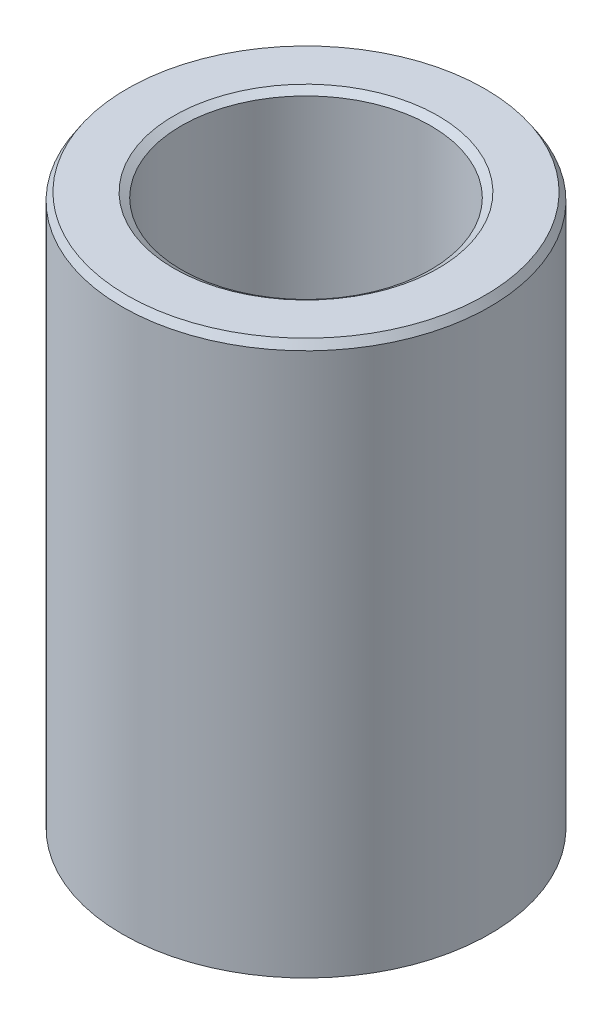
ISO-10303-21;
HEADER;
FILE_DESCRIPTION(('STEP AP214'),'2;1');
FILE_NAME('part.step','',(''),(''),'','','');
FILE_SCHEMA(('AUTOMOTIVE_DESIGN { 1 0 10303 214 1 1 1 1 }'));
ENDSEC;
DATA;
#1=APPLICATION_CONTEXT('core data for automotive mechanical design processes');
#2=APPLICATION_PROTOCOL_DEFINITION('international standard','automotive_design',2000,#1);
#3=PRODUCT_CONTEXT('',#1,'mechanical');
#4=PRODUCT('Part','Part','',(#3));
#5=PRODUCT_RELATED_PRODUCT_CATEGORY('part','',(#4));
#6=PRODUCT_DEFINITION_FORMATION('','',#4);
#7=PRODUCT_DEFINITION_CONTEXT('part definition',#1,'design');
#8=PRODUCT_DEFINITION('design','',#6,#7);
#9=PRODUCT_DEFINITION_SHAPE('','',#8);
#10=(LENGTH_UNIT() NAMED_UNIT(*) SI_UNIT(.MILLI.,.METRE.));
#11=(NAMED_UNIT(*) PLANE_ANGLE_UNIT() SI_UNIT($,.RADIAN.));
#12=(NAMED_UNIT(*) SI_UNIT($,.STERADIAN.) SOLID_ANGLE_UNIT());
#13=UNCERTAINTY_MEASURE_WITH_UNIT(LENGTH_MEASURE(1.E-05),#10,'distance_accuracy_value','');
#14=(GEOMETRIC_REPRESENTATION_CONTEXT(3) GLOBAL_UNCERTAINTY_ASSIGNED_CONTEXT((#13)) GLOBAL_UNIT_ASSIGNED_CONTEXT((#10,
#11,#12)) REPRESENTATION_CONTEXT('',''));
#15=CARTESIAN_POINT('',(0.,0.,0.));
#16=DIRECTION('',(0.,0.,1.));
#17=DIRECTION('',(1.,0.,0.));
#18=AXIS2_PLACEMENT_3D('',#15,#16,#17);
#19=CARTESIAN_POINT('',(0.,30.2188998802696,0.));
#20=DIRECTION('',(0.,-1.,0.));
#21=DIRECTION('',(0.,0.,-1.));
#22=AXIS2_PLACEMENT_3D('',#19,#20,#21);
#23=CYLINDRICAL_SURFACE('',#22,10.);
#24=CARTESIAN_POINT('',(0.,0.264981801475061,0.));
#25=DIRECTION('',(0.,1.,0.));
#26=DIRECTION('',(0.,0.,1.));
#27=AXIS2_PLACEMENT_3D('',#24,#25,#26);
#28=CIRCLE('',#27,10.);
#29=CARTESIAN_POINT('',(0.,0.264981801475061,-10.));
#30=VERTEX_POINT('',#29);
#31=EDGE_CURVE('E10',#30,#30,#28,.T.);
#32=CARTESIAN_POINT('',(0.,29.8114514143489,0.));
#33=DIRECTION('',(0.,1.,0.));
#34=DIRECTION('',(0.,0.,1.));
#35=AXIS2_PLACEMENT_3D('',#32,#33,#34);
#36=CIRCLE('',#35,10.);
#37=CARTESIAN_POINT('',(0.,29.8114514143489,-10.));
#38=VERTEX_POINT('',#37);
#39=EDGE_CURVE('E50',#38,#38,#36,.F.);
#40=CARTESIAN_POINT('',(0.,0.264981801475061,-10.));
#41=CARTESIAN_POINT('',(0.,0.572757526609163,-10.));
#42=CARTESIAN_POINT('',(0.,0.880533251743264,-10.));
#43=CARTESIAN_POINT('',(0.,1.49608470201147,-10.));
#44=CARTESIAN_POINT('',(0.,1.80386042714557,-10.));
#45=CARTESIAN_POINT('',(0.,2.41941187741378,-10.));
#46=CARTESIAN_POINT('',(0.,2.72718760254788,-10.));
#47=CARTESIAN_POINT('',(0.,3.34273905281608,-10.));
#48=CARTESIAN_POINT('',(0.,3.65051477795019,-10.));
#49=CARTESIAN_POINT('',(0.,4.26606622821839,-10.));
#50=CARTESIAN_POINT('',(0.,4.57384195335249,-10.));
#51=CARTESIAN_POINT('',(0.,5.1893934036207,-10.));
#52=CARTESIAN_POINT('',(0.,5.4971691287548,-10.));
#53=CARTESIAN_POINT('',(0.,6.112720579023,-10.));
#54=CARTESIAN_POINT('',(0.,6.42049630415711,-10.));
#55=CARTESIAN_POINT('',(0.,7.03604775442531,-10.));
#56=CARTESIAN_POINT('',(0.,7.34382347955941,-10.));
#57=CARTESIAN_POINT('',(0.,7.95937492982762,-10.));
#58=CARTESIAN_POINT('',(0.,8.26715065496172,-10.));
#59=CARTESIAN_POINT('',(0.,8.88270210522992,-10.));
#60=CARTESIAN_POINT('',(0.,9.19047783036403,-10.));
#61=CARTESIAN_POINT('',(0.,9.80602928063223,-10.));
#62=CARTESIAN_POINT('',(0.,10.1138050057663,-10.));
#63=CARTESIAN_POINT('',(0.,10.7293564560345,-10.));
#64=CARTESIAN_POINT('',(0.,11.0371321811686,-10.));
#65=CARTESIAN_POINT('',(0.,11.6526836314368,-10.));
#66=CARTESIAN_POINT('',(0.,11.9604593565709,-10.));
#67=CARTESIAN_POINT('',(0.,12.5760108068392,-10.));
#68=CARTESIAN_POINT('',(0.,12.8837865319733,-10.));
#69=CARTESIAN_POINT('',(0.,13.4993379822415,-10.));
#70=CARTESIAN_POINT('',(0.,13.8071137073756,-10.));
#71=CARTESIAN_POINT('',(0.,14.4226651576438,-10.));
#72=CARTESIAN_POINT('',(0.,14.7304408827779,-10.));
#73=CARTESIAN_POINT('',(0.,15.3459923330461,-10.));
#74=CARTESIAN_POINT('',(0.,15.6537680581802,-10.));
#75=CARTESIAN_POINT('',(0.,16.2693195084484,-10.));
#76=CARTESIAN_POINT('',(0.,16.5770952335825,-10.));
#77=CARTESIAN_POINT('',(0.,17.1926466838507,-10.));
#78=CARTESIAN_POINT('',(0.,17.5004224089848,-10.));
#79=CARTESIAN_POINT('',(0.,18.115973859253,-10.));
#80=CARTESIAN_POINT('',(0.,18.4237495843871,-10.));
#81=CARTESIAN_POINT('',(0.,19.0393010346553,-10.));
#82=CARTESIAN_POINT('',(0.,19.3470767597894,-10.));
#83=CARTESIAN_POINT('',(0.,19.9626282100576,-10.));
#84=CARTESIAN_POINT('',(0.,20.2704039351917,-10.));
#85=CARTESIAN_POINT('',(0.,20.8859553854599,-10.));
#86=CARTESIAN_POINT('',(0.,21.193731110594,-10.));
#87=CARTESIAN_POINT('',(0.,21.8092825608622,-10.));
#88=CARTESIAN_POINT('',(0.,22.1170582859963,-10.));
#89=CARTESIAN_POINT('',(0.,22.7326097362645,-10.));
#90=CARTESIAN_POINT('',(0.,23.0403854613986,-10.));
#91=CARTESIAN_POINT('',(0.,23.6559369116668,-10.));
#92=CARTESIAN_POINT('',(0.,23.9637126368009,-10.));
#93=CARTESIAN_POINT('',(0.,24.5792640870691,-10.));
#94=CARTESIAN_POINT('',(0.,24.8870398122032,-10.));
#95=CARTESIAN_POINT('',(0.,25.5025912624714,-10.));
#96=CARTESIAN_POINT('',(0.,25.8103669876055,-10.));
#97=CARTESIAN_POINT('',(0.,26.4259184378737,-10.));
#98=CARTESIAN_POINT('',(0.,26.7336941630079,-10.));
#99=CARTESIAN_POINT('',(0.,27.3492456132761,-10.));
#100=CARTESIAN_POINT('',(0.,27.6570213384102,-10.));
#101=CARTESIAN_POINT('',(0.,28.2725727886784,-10.));
#102=CARTESIAN_POINT('',(0.,28.5803485138125,-10.));
#103=CARTESIAN_POINT('',(0.,29.1958999640807,-10.));
#104=CARTESIAN_POINT('',(0.,29.5036756892148,-10.));
#105=CARTESIAN_POINT('',(0.,29.8114514143489,-10.));
#106=B_SPLINE_CURVE_WITH_KNOTS('',3,(#40,#41,#42,#43,#44,#45,#46,#47,#48,#49,#50,#51,#52,#53,
#54,#55,#56,#57,#58,#59,#60,#61,#62,#63,#64,#65,#66,#67,#68,#69,#70,#71,#72,#73,#74,#75,#76,#77,
#78,#79,#80,#81,#82,#83,#84,#85,#86,#87,#88,#89,#90,#91,#92,#93,#94,#95,#96,#97,#98,#99,#100,
#101,#102,#103,#104,#105),.UNSPECIFIED.,.F.,.F.,(4,2,2,2,2,2,2,2,2,2,2,2,2,2,2,2,2,2,2,2,2,2,2,
2,2,2,2,2,2,2,2,2,4),(0.,0.923327175402305,1.84665435080461,2.76998152620692,3.69330870160923,
4.61663587701153,5.53996305241384,6.46329022781615,7.38661740321845,8.30994457862076,
9.23327175402307,10.1565989294254,11.0799261048277,12.00325328023,12.9265804556323,
13.8499076310346,14.7732348064369,15.6965619818392,16.6198891572415,17.5432163326438,
18.4665435080461,19.3898706834484,20.3131978588507,21.2365250342531,22.1598522096554,
23.0831793850577,24.00650656046,24.9298337358623,25.8531609112646,26.7764880866669,
27.6998152620692,28.6231424374715,29.5464696128738),.UNSPECIFIED.);
#107=EDGE_CURVE('BSEAM39',#30,#38,#106,.T.);
#108=ORIENTED_EDGE('',*,*,#31,.T.);
#109=ORIENTED_EDGE('',*,*,#39,.T.);
#110=ORIENTED_EDGE('',*,*,#107,.T.);
#111=ORIENTED_EDGE('',*,*,#107,.F.);
#112=EDGE_LOOP('',(#108,#110,#109,#111));
#113=FACE_BOUND('',#112,.T.);
#114=ADVANCED_FACE('F39',(#113),#23,.T.);
#115=CARTESIAN_POINT('',(0.,30.2188998802696,0.));
#116=DIRECTION('',(0.,1.,0.));
#117=DIRECTION('',(0.,0.,1.));
#118=AXIS2_PLACEMENT_3D('',#115,#116,#117);
#119=PLANE('',#118);
#120=CARTESIAN_POINT('',(0.,30.2188998802696,0.));
#121=DIRECTION('',(0.,1.,0.));
#122=DIRECTION('',(0.,0.,1.));
#123=AXIS2_PLACEMENT_3D('',#120,#121,#122);
#124=CIRCLE('',#123,7.1906507334478);
#125=CARTESIAN_POINT('',(0.,30.2188998802696,7.1906507334478));
#126=VERTEX_POINT('',#125);
#127=EDGE_CURVE('E58',#126,#126,#124,.F.);
#128=ORIENTED_EDGE('',*,*,#127,.T.);
#129=EDGE_LOOP('',(#128));
#130=FACE_BOUND('',#129,.T.);
#131=CARTESIAN_POINT('',(0.,30.2188998802696,0.));
#132=DIRECTION('',(0.,1.,0.));
#133=DIRECTION('',(0.,0.,1.));
#134=AXIS2_PLACEMENT_3D('',#131,#132,#133);
#135=CIRCLE('',#134,9.73501819852497);
#136=CARTESIAN_POINT('',(0.,30.2188998802696,9.73501819852497));
#137=VERTEX_POINT('',#136);
#138=EDGE_CURVE('E61',#137,#137,#135,.T.);
#139=ORIENTED_EDGE('',*,*,#138,.T.);
#140=EDGE_LOOP('',(#139));
#141=FACE_BOUND('',#140,.T.);
#142=ADVANCED_FACE('F88',(#130,#141),#119,.T.);
#143=CARTESIAN_POINT('',(0.,0.,0.));
#144=DIRECTION('',(0.,1.,0.));
#145=DIRECTION('',(0.,0.,1.));
#146=AXIS2_PLACEMENT_3D('',#143,#144,#145);
#147=PLANE('',#146);
#148=CARTESIAN_POINT('',(0.,0.,0.));
#149=DIRECTION('',(0.,1.,0.));
#150=DIRECTION('',(0.,0.,1.));
#151=AXIS2_PLACEMENT_3D('',#148,#149,#150);
#152=CIRCLE('',#151,7.04818406900203);
#153=CARTESIAN_POINT('',(0.,0.,7.04818406900203));
#154=VERTEX_POINT('',#153);
#155=EDGE_CURVE('E51',#154,#154,#152,.T.);
#156=ORIENTED_EDGE('',*,*,#155,.T.);
#157=EDGE_LOOP('',(#156));
#158=FACE_BOUND('',#157,.T.);
#159=CARTESIAN_POINT('',(0.,0.,0.));
#160=DIRECTION('',(0.,1.,0.));
#161=DIRECTION('',(0.,0.,1.));
#162=AXIS2_PLACEMENT_3D('',#159,#160,#161);
#163=CIRCLE('',#162,9.59255153407919);
#164=CARTESIAN_POINT('',(0.,0.,9.59255153407919));
#165=VERTEX_POINT('',#164);
#166=EDGE_CURVE('E54',#165,#165,#163,.F.);
#167=ORIENTED_EDGE('',*,*,#166,.T.);
#168=EDGE_LOOP('',(#167));
#169=FACE_BOUND('',#168,.T.);
#170=ADVANCED_FACE('F83',(#158,#169),#147,.F.);
#171=CARTESIAN_POINT('',(0.,30.2188998802696,0.));
#172=DIRECTION('',(0.,-1.,0.));
#173=DIRECTION('',(0.,0.,-1.));
#174=AXIS2_PLACEMENT_3D('',#171,#172,#173);
#175=CYLINDRICAL_SURFACE('',#174,6.78320226752698);
#176=CARTESIAN_POINT('',(0.,29.9539180787946,0.));
#177=DIRECTION('',(0.,1.,0.));
#178=DIRECTION('',(0.,0.,1.));
#179=AXIS2_PLACEMENT_3D('',#176,#177,#178);
#180=CIRCLE('',#179,6.78320226752698);
#181=CARTESIAN_POINT('',(0.,29.9539180787946,-6.78320226752698));
#182=VERTEX_POINT('',#181);
#183=EDGE_CURVE('E67',#182,#182,#180,.T.);
#184=CARTESIAN_POINT('',(0.,0.407448465920786,0.));
#185=DIRECTION('',(0.,1.,0.));
#186=DIRECTION('',(0.,0.,1.));
#187=AXIS2_PLACEMENT_3D('',#184,#185,#186);
#188=CIRCLE('',#187,6.78320226752698);
#189=CARTESIAN_POINT('',(0.,0.407448465920782,-6.78320226752698));
#190=VERTEX_POINT('',#189);
#191=EDGE_CURVE('E69',#190,#190,#188,.F.);
#192=CARTESIAN_POINT('',(0.,29.9539180787946,-6.78320226752698));
#193=CARTESIAN_POINT('',(0.,29.6461423536605,-6.78320226752698));
#194=CARTESIAN_POINT('',(0.,29.3383666285264,-6.78320226752698));
#195=CARTESIAN_POINT('',(0.,28.7228151782582,-6.78320226752698));
#196=CARTESIAN_POINT('',(0.,28.4150394531241,-6.78320226752698));
#197=CARTESIAN_POINT('',(0.,27.7994880028559,-6.78320226752698));
#198=CARTESIAN_POINT('',(0.,27.4917122777218,-6.78320226752698));
#199=CARTESIAN_POINT('',(0.,26.8761608274536,-6.78320226752698));
#200=CARTESIAN_POINT('',(0.,26.5683851023195,-6.78320226752698));
#201=CARTESIAN_POINT('',(0.,25.9528336520513,-6.78320226752698));
#202=CARTESIAN_POINT('',(0.,25.6450579269172,-6.78320226752698));
#203=CARTESIAN_POINT('',(0.,25.029506476649,-6.78320226752698));
#204=CARTESIAN_POINT('',(0.,24.7217307515148,-6.78320226752698));
#205=CARTESIAN_POINT('',(0.,24.1061793012466,-6.78320226752698));
#206=CARTESIAN_POINT('',(0.,23.7984035761125,-6.78320226752698));
#207=CARTESIAN_POINT('',(0.,23.1828521258443,-6.78320226752698));
#208=CARTESIAN_POINT('',(0.,22.8750764007102,-6.78320226752698));
#209=CARTESIAN_POINT('',(0.,22.259524950442,-6.78320226752698));
#210=CARTESIAN_POINT('',(0.,21.9517492253079,-6.78320226752698));
#211=CARTESIAN_POINT('',(0.,21.3361977750397,-6.78320226752698));
#212=CARTESIAN_POINT('',(0.,21.0284220499056,-6.78320226752698));
#213=CARTESIAN_POINT('',(0.,20.4128705996374,-6.78320226752698));
#214=CARTESIAN_POINT('',(0.,20.1050948745033,-6.78320226752698));
#215=CARTESIAN_POINT('',(0.,19.4895434242351,-6.78320226752698));
#216=CARTESIAN_POINT('',(0.,19.181767699101,-6.78320226752698));
#217=CARTESIAN_POINT('',(0.,18.5662162488328,-6.78320226752698));
#218=CARTESIAN_POINT('',(0.,18.2584405236987,-6.78320226752698));
#219=CARTESIAN_POINT('',(0.,17.6428890734305,-6.78320226752698));
#220=CARTESIAN_POINT('',(0.,17.3351133482964,-6.78320226752698));
#221=CARTESIAN_POINT('',(0.,16.7195618980282,-6.78320226752698));
#222=CARTESIAN_POINT('',(0.,16.4117861728941,-6.78320226752698));
#223=CARTESIAN_POINT('',(0.,15.7962347226259,-6.78320226752698));
#224=CARTESIAN_POINT('',(0.,15.4884589974918,-6.78320226752698));
#225=CARTESIAN_POINT('',(0.,14.8729075472236,-6.78320226752698));
#226=CARTESIAN_POINT('',(0.,14.5651318220895,-6.78320226752698));
#227=CARTESIAN_POINT('',(0.,13.9495803718213,-6.78320226752698));
#228=CARTESIAN_POINT('',(0.,13.6418046466872,-6.78320226752698));
#229=CARTESIAN_POINT('',(0.,13.026253196419,-6.78320226752698));
#230=CARTESIAN_POINT('',(0.,12.7184774712849,-6.78320226752698));
#231=CARTESIAN_POINT('',(0.,12.1029260210167,-6.78320226752698));
#232=CARTESIAN_POINT('',(0.,11.7951502958826,-6.78320226752698));
#233=CARTESIAN_POINT('',(0.,11.1795988456144,-6.78320226752698));
#234=CARTESIAN_POINT('',(0.,10.8718231204803,-6.78320226752698));
#235=CARTESIAN_POINT('',(0.,10.256271670212,-6.78320226752698));
#236=CARTESIAN_POINT('',(0.,9.94849594507795,-6.78320226752698));
#237=CARTESIAN_POINT('',(0.,9.33294449480974,-6.78320226752698));
#238=CARTESIAN_POINT('',(0.,9.02516876967564,-6.78320226752698));
#239=CARTESIAN_POINT('',(0.,8.40961731940744,-6.78320226752698));
#240=CARTESIAN_POINT('',(0.,8.10184159427333,-6.78320226752698));
#241=CARTESIAN_POINT('',(0.,7.48629014400513,-6.78320226752698));
#242=CARTESIAN_POINT('',(0.,7.17851441887103,-6.78320226752698));
#243=CARTESIAN_POINT('',(0.,6.56296296860283,-6.78320226752698));
#244=CARTESIAN_POINT('',(0.,6.25518724346872,-6.78320226752698));
#245=CARTESIAN_POINT('',(0.,5.63963579320052,-6.78320226752698));
#246=CARTESIAN_POINT('',(0.,5.33186006806642,-6.78320226752698));
#247=CARTESIAN_POINT('',(0.,4.71630861779821,-6.78320226752698));
#248=CARTESIAN_POINT('',(0.,4.40853289266411,-6.78320226752698));
#249=CARTESIAN_POINT('',(0.,3.79298144239591,-6.78320226752698));
#250=CARTESIAN_POINT('',(0.,3.4852057172618,-6.78320226752698));
#251=CARTESIAN_POINT('',(0.,2.8696542669936,-6.78320226752698));
#252=CARTESIAN_POINT('',(0.,2.5618785418595,-6.78320226752698));
#253=CARTESIAN_POINT('',(0.,1.94632709159129,-6.78320226752698));
#254=CARTESIAN_POINT('',(0.,1.63855136645719,-6.78320226752698));
#255=CARTESIAN_POINT('',(0.,1.02299991618899,-6.78320226752698));
#256=CARTESIAN_POINT('',(0.,0.715224191054884,-6.78320226752698));
#257=CARTESIAN_POINT('',(0.,0.407448465920782,-6.78320226752698));
#258=B_SPLINE_CURVE_WITH_KNOTS('',3,(#192,#193,#194,#195,#196,#197,#198,#199,#200,#201,#202,
#203,#204,#205,#206,#207,#208,#209,#210,#211,#212,#213,#214,#215,#216,#217,#218,#219,#220,#221,
#222,#223,#224,#225,#226,#227,#228,#229,#230,#231,#232,#233,#234,#235,#236,#237,#238,#239,#240,
#241,#242,#243,#244,#245,#246,#247,#248,#249,#250,#251,#252,#253,#254,#255,#256,#257),
.UNSPECIFIED.,.F.,.F.,(4,2,2,2,2,2,2,2,2,2,2,2,2,2,2,2,2,2,2,2,2,2,2,2,2,2,2,2,2,2,2,2,4),(0.,
0.923327175402305,1.84665435080461,2.76998152620692,3.69330870160922,4.61663587701153,
5.53996305241384,6.46329022781614,7.38661740321845,8.30994457862075,9.23327175402306,
10.1565989294254,11.0799261048277,12.00325328023,12.9265804556323,13.8499076310346,
14.7732348064369,15.6965619818392,16.6198891572415,17.5432163326438,18.4665435080461,
19.3898706834484,20.3131978588507,21.236525034253,22.1598522096553,23.0831793850577,
24.00650656046,24.9298337358623,25.8531609112646,26.7764880866669,27.6998152620692,
28.6231424374715,29.5464696128738),.UNSPECIFIED.);
#259=EDGE_CURVE('BSEAM71',#182,#190,#258,.T.);
#260=ORIENTED_EDGE('',*,*,#183,.T.);
#261=ORIENTED_EDGE('',*,*,#191,.T.);
#262=ORIENTED_EDGE('',*,*,#259,.T.);
#263=ORIENTED_EDGE('',*,*,#259,.F.);
#264=EDGE_LOOP('',(#260,#262,#261,#263));
#265=FACE_BOUND('',#264,.T.);
#266=ADVANCED_FACE('F71',(#265),#175,.F.);
#267=CARTESIAN_POINT('',(0.,29.9539180787946,0.));
#268=DIRECTION('',(0.,1.,0.));
#269=DIRECTION('',(0.,0.,1.));
#270=AXIS2_PLACEMENT_3D('',#267,#268,#269);
#271=CONICAL_SURFACE('',#270,6.78320226752698,0.994179081263223);
#272=ORIENTED_EDGE('',*,*,#127,.F.);
#273=EDGE_LOOP('',(#272));
#274=FACE_BOUND('',#273,.T.);
#275=ORIENTED_EDGE('',*,*,#183,.F.);
#276=EDGE_LOOP('',(#275));
#277=FACE_BOUND('',#276,.T.);
#278=ADVANCED_FACE('F77',(#274,#277),#271,.F.);
#279=CARTESIAN_POINT('',(0.,0.,0.));
#280=DIRECTION('',(0.,-1.,0.));
#281=DIRECTION('',(0.,0.,-1.));
#282=AXIS2_PLACEMENT_3D('',#279,#280,#281);
#283=CONICAL_SURFACE('',#282,7.04818406900203,0.576617245531673);
#284=ORIENTED_EDGE('',*,*,#191,.F.);
#285=EDGE_LOOP('',(#284));
#286=FACE_BOUND('',#285,.T.);
#287=ORIENTED_EDGE('',*,*,#155,.F.);
#288=EDGE_LOOP('',(#287));
#289=FACE_BOUND('',#288,.T.);
#290=ADVANCED_FACE('F73',(#286,#289),#283,.F.);
#291=CARTESIAN_POINT('',(0.,0.264981801475061,0.));
#292=DIRECTION('',(0.,1.,0.));
#293=DIRECTION('',(0.,0.,1.));
#294=AXIS2_PLACEMENT_3D('',#291,#292,#293);
#295=CONICAL_SURFACE('',#294,10.,0.994179081263221);
#296=ORIENTED_EDGE('',*,*,#166,.F.);
#297=EDGE_LOOP('',(#296));
#298=FACE_BOUND('',#297,.T.);
#299=ORIENTED_EDGE('',*,*,#31,.F.);
#300=EDGE_LOOP('',(#299));
#301=FACE_BOUND('',#300,.T.);
#302=ADVANCED_FACE('F76',(#298,#301),#295,.T.);
#303=CARTESIAN_POINT('',(0.,30.2188998802696,0.));
#304=DIRECTION('',(0.,-1.,0.));
#305=DIRECTION('',(0.,0.,-1.));
#306=AXIS2_PLACEMENT_3D('',#303,#304,#305);
#307=CONICAL_SURFACE('',#306,9.73501819852497,0.576617245531674);
#308=ORIENTED_EDGE('',*,*,#39,.F.);
#309=EDGE_LOOP('',(#308));
#310=FACE_BOUND('',#309,.T.);
#311=ORIENTED_EDGE('',*,*,#138,.F.);
#312=EDGE_LOOP('',(#311));
#313=FACE_BOUND('',#312,.T.);
#314=ADVANCED_FACE('F45',(#310,#313),#307,.T.);
#315=CLOSED_SHELL('',(#114,#142,#170,#266,#278,#290,#302,#314));
#316=MANIFOLD_SOLID_BREP('B2',#315);
#317=ADVANCED_BREP_SHAPE_REPRESENTATION('',(#18,#316),#14);
#318=SHAPE_DEFINITION_REPRESENTATION(#9,#317);
ENDSEC;
END-ISO-10303-21;
